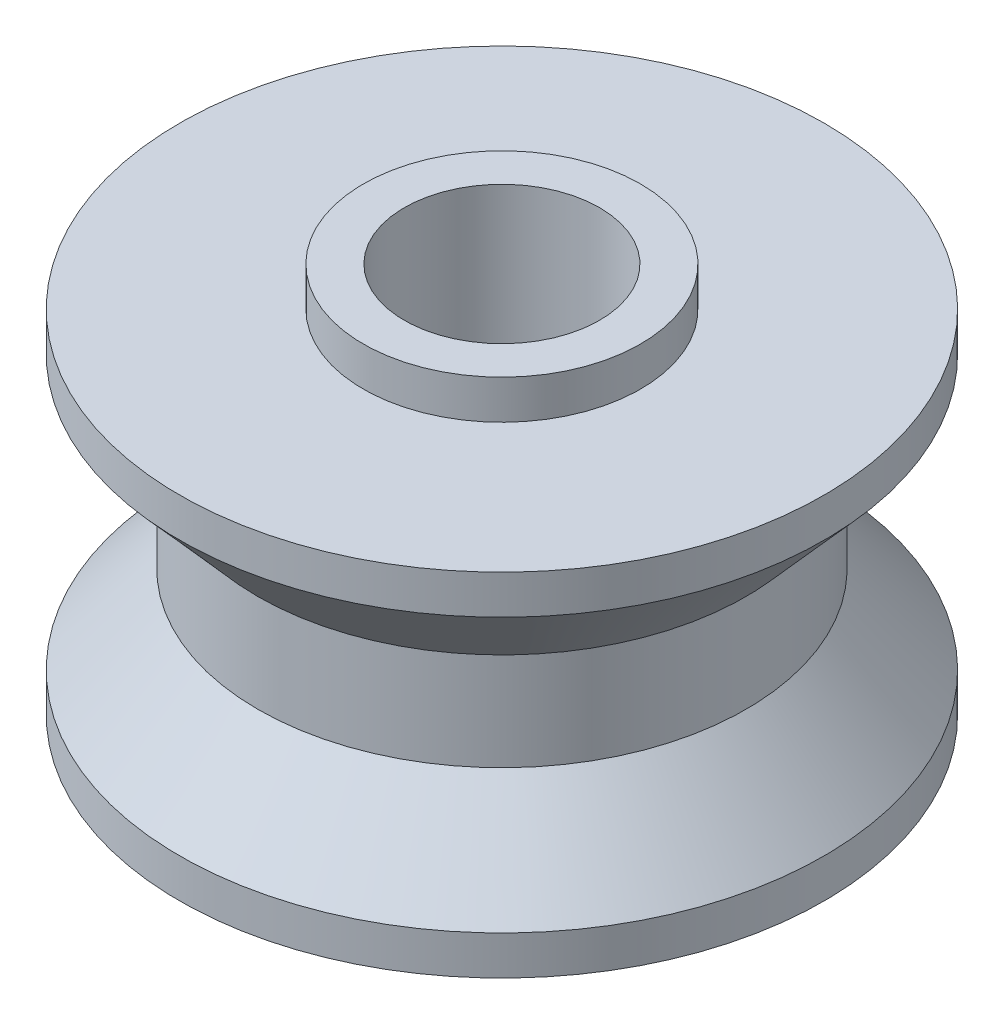
ISO-10303-21;
HEADER;
FILE_DESCRIPTION(('STEP AP214'),'2;1');
FILE_NAME('part.step','',(''),(''),'','','');
FILE_SCHEMA(('AUTOMOTIVE_DESIGN { 1 0 10303 214 1 1 1 1 }'));
ENDSEC;
DATA;
#1=APPLICATION_CONTEXT('core data for automotive mechanical design processes');
#2=APPLICATION_PROTOCOL_DEFINITION('international standard','automotive_design',2000,#1);
#3=PRODUCT_CONTEXT('',#1,'mechanical');
#4=PRODUCT('Part','Part','',(#3));
#5=PRODUCT_RELATED_PRODUCT_CATEGORY('part','',(#4));
#6=PRODUCT_DEFINITION_FORMATION('','',#4);
#7=PRODUCT_DEFINITION_CONTEXT('part definition',#1,'design');
#8=PRODUCT_DEFINITION('design','',#6,#7);
#9=PRODUCT_DEFINITION_SHAPE('','',#8);
#10=(LENGTH_UNIT() NAMED_UNIT(*) SI_UNIT(.MILLI.,.METRE.));
#11=(NAMED_UNIT(*) PLANE_ANGLE_UNIT() SI_UNIT($,.RADIAN.));
#12=(NAMED_UNIT(*) SI_UNIT($,.STERADIAN.) SOLID_ANGLE_UNIT());
#13=UNCERTAINTY_MEASURE_WITH_UNIT(LENGTH_MEASURE(1.E-05),#10,'distance_accuracy_value','');
#14=(GEOMETRIC_REPRESENTATION_CONTEXT(3) GLOBAL_UNCERTAINTY_ASSIGNED_CONTEXT((#13)) GLOBAL_UNIT_ASSIGNED_CONTEXT((#10,
#11,#12)) REPRESENTATION_CONTEXT('',''));
#15=CARTESIAN_POINT('',(0.,0.,0.));
#16=DIRECTION('',(0.,0.,1.));
#17=DIRECTION('',(1.,0.,0.));
#18=AXIS2_PLACEMENT_3D('',#15,#16,#17);
#19=CARTESIAN_POINT('',(0.,0.,0.));
#20=DIRECTION('',(0.,-1.,0.));
#21=DIRECTION('',(0.,0.,-1.));
#22=AXIS2_PLACEMENT_3D('',#19,#20,#21);
#23=CYLINDRICAL_SURFACE('',#22,2.5);
#24=CARTESIAN_POINT('',(0.,-5.5,0.));
#25=DIRECTION('',(0.,-1.,0.));
#26=DIRECTION('',(0.,0.,-1.));
#27=AXIS2_PLACEMENT_3D('',#24,#25,#26);
#28=CIRCLE('',#27,2.5);
#29=CARTESIAN_POINT('',(0.,-5.5,-2.5));
#30=VERTEX_POINT('',#29);
#31=EDGE_CURVE('E10',#30,#30,#28,.T.);
#32=ORIENTED_EDGE('',*,*,#31,.T.);
#33=EDGE_LOOP('',(#32));
#34=FACE_BOUND('',#33,.T.);
#35=CARTESIAN_POINT('',(0.,5.5,0.));
#36=DIRECTION('',(0.,-1.,0.));
#37=DIRECTION('',(0.,0.,-1.));
#38=AXIS2_PLACEMENT_3D('',#35,#36,#37);
#39=CIRCLE('',#38,2.5);
#40=CARTESIAN_POINT('',(0.,5.5,-2.5));
#41=VERTEX_POINT('',#40);
#42=EDGE_CURVE('E72',#41,#41,#39,.T.);
#43=ORIENTED_EDGE('',*,*,#42,.F.);
#44=EDGE_LOOP('',(#43));
#45=FACE_BOUND('',#44,.T.);
#46=ADVANCED_FACE('F32',(#34,#45),#23,.F.);
#47=CARTESIAN_POINT('',(2.5,-5.5,0.));
#48=DIRECTION('',(0.,-1.,0.));
#49=DIRECTION('',(0.,0.,-1.));
#50=AXIS2_PLACEMENT_3D('',#47,#48,#49);
#51=PLANE('',#50);
#52=CARTESIAN_POINT('',(0.,-5.5,0.));
#53=DIRECTION('',(0.,-1.,0.));
#54=DIRECTION('',(0.,0.,-1.));
#55=AXIS2_PLACEMENT_3D('',#52,#53,#54);
#56=CIRCLE('',#55,3.55);
#57=CARTESIAN_POINT('',(0.,-5.5,-3.55));
#58=VERTEX_POINT('',#57);
#59=EDGE_CURVE('E38',#58,#58,#56,.T.);
#60=ORIENTED_EDGE('',*,*,#59,.T.);
#61=EDGE_LOOP('',(#60));
#62=FACE_BOUND('',#61,.T.);
#63=ORIENTED_EDGE('',*,*,#31,.F.);
#64=EDGE_LOOP('',(#63));
#65=FACE_BOUND('',#64,.T.);
#66=ADVANCED_FACE('F80',(#62,#65),#51,.T.);
#67=CARTESIAN_POINT('',(0.,0.,0.));
#68=DIRECTION('',(0.,-1.,0.));
#69=DIRECTION('',(0.,0.,-1.));
#70=AXIS2_PLACEMENT_3D('',#67,#68,#69);
#71=CYLINDRICAL_SURFACE('',#70,3.55);
#72=CARTESIAN_POINT('',(0.,-4.5,0.));
#73=DIRECTION('',(0.,-1.,0.));
#74=DIRECTION('',(0.,0.,-1.));
#75=AXIS2_PLACEMENT_3D('',#72,#73,#74);
#76=CIRCLE('',#75,3.55);
#77=CARTESIAN_POINT('',(0.,-4.5,-3.55));
#78=VERTEX_POINT('',#77);
#79=EDGE_CURVE('E42',#78,#78,#76,.T.);
#80=ORIENTED_EDGE('',*,*,#79,.T.);
#81=EDGE_LOOP('',(#80));
#82=FACE_BOUND('',#81,.T.);
#83=ORIENTED_EDGE('',*,*,#59,.F.);
#84=EDGE_LOOP('',(#83));
#85=FACE_BOUND('',#84,.T.);
#86=ADVANCED_FACE('F84',(#82,#85),#71,.T.);
#87=CARTESIAN_POINT('',(3.55,-4.5,0.));
#88=DIRECTION('',(0.,-1.,0.));
#89=DIRECTION('',(0.,0.,-1.));
#90=AXIS2_PLACEMENT_3D('',#87,#88,#89);
#91=PLANE('',#90);
#92=CARTESIAN_POINT('',(0.,-4.5,0.));
#93=DIRECTION('',(0.,-1.,0.));
#94=DIRECTION('',(0.,0.,-1.));
#95=AXIS2_PLACEMENT_3D('',#92,#93,#94);
#96=CIRCLE('',#95,8.25);
#97=CARTESIAN_POINT('',(0.,-4.5,-8.25));
#98=VERTEX_POINT('',#97);
#99=EDGE_CURVE('E46',#98,#98,#96,.T.);
#100=ORIENTED_EDGE('',*,*,#99,.T.);
#101=EDGE_LOOP('',(#100));
#102=FACE_BOUND('',#101,.T.);
#103=ORIENTED_EDGE('',*,*,#79,.F.);
#104=EDGE_LOOP('',(#103));
#105=FACE_BOUND('',#104,.T.);
#106=ADVANCED_FACE('F88',(#102,#105),#91,.T.);
#107=CARTESIAN_POINT('',(0.,0.,0.));
#108=DIRECTION('',(0.,-1.,0.));
#109=DIRECTION('',(0.,0.,-1.));
#110=AXIS2_PLACEMENT_3D('',#107,#108,#109);
#111=CYLINDRICAL_SURFACE('',#110,8.25);
#112=CARTESIAN_POINT('',(0.,-3.5,0.));
#113=DIRECTION('',(0.,-1.,0.));
#114=DIRECTION('',(0.,0.,-1.));
#115=AXIS2_PLACEMENT_3D('',#112,#113,#114);
#116=CIRCLE('',#115,8.25);
#117=CARTESIAN_POINT('',(0.,-3.5,-8.25));
#118=VERTEX_POINT('',#117);
#119=EDGE_CURVE('E51',#118,#118,#116,.T.);
#120=ORIENTED_EDGE('',*,*,#119,.T.);
#121=EDGE_LOOP('',(#120));
#122=FACE_BOUND('',#121,.T.);
#123=ORIENTED_EDGE('',*,*,#99,.F.);
#124=EDGE_LOOP('',(#123));
#125=FACE_BOUND('',#124,.T.);
#126=ADVANCED_FACE('F95',(#122,#125),#111,.T.);
#127=CARTESIAN_POINT('',(0.,-3.5,0.));
#128=DIRECTION('',(0.,-1.,0.));
#129=DIRECTION('',(0.,0.,-1.));
#130=AXIS2_PLACEMENT_3D('',#127,#128,#129);
#131=CONICAL_SURFACE('',#130,8.25,0.726642340681726);
#132=CARTESIAN_POINT('',(0.,-1.25,0.));
#133=DIRECTION('',(0.,-1.,0.));
#134=DIRECTION('',(0.,0.,-1.));
#135=AXIS2_PLACEMENT_3D('',#132,#133,#134);
#136=CIRCLE('',#135,6.25);
#137=CARTESIAN_POINT('',(0.,-1.25,-6.25));
#138=VERTEX_POINT('',#137);
#139=EDGE_CURVE('E54',#138,#138,#136,.T.);
#140=ORIENTED_EDGE('',*,*,#139,.T.);
#141=EDGE_LOOP('',(#140));
#142=FACE_BOUND('',#141,.T.);
#143=ORIENTED_EDGE('',*,*,#119,.F.);
#144=EDGE_LOOP('',(#143));
#145=FACE_BOUND('',#144,.T.);
#146=ADVANCED_FACE('F99',(#142,#145),#131,.T.);
#147=CARTESIAN_POINT('',(0.,0.,0.));
#148=DIRECTION('',(0.,-1.,0.));
#149=DIRECTION('',(0.,0.,-1.));
#150=AXIS2_PLACEMENT_3D('',#147,#148,#149);
#151=CYLINDRICAL_SURFACE('',#150,6.25);
#152=CARTESIAN_POINT('',(0.,1.25,0.));
#153=DIRECTION('',(0.,-1.,0.));
#154=DIRECTION('',(0.,0.,-1.));
#155=AXIS2_PLACEMENT_3D('',#152,#153,#154);
#156=CIRCLE('',#155,6.25);
#157=CARTESIAN_POINT('',(0.,1.25,-6.25));
#158=VERTEX_POINT('',#157);
#159=EDGE_CURVE('E57',#158,#158,#156,.T.);
#160=ORIENTED_EDGE('',*,*,#159,.T.);
#161=EDGE_LOOP('',(#160));
#162=FACE_BOUND('',#161,.T.);
#163=ORIENTED_EDGE('',*,*,#139,.F.);
#164=EDGE_LOOP('',(#163));
#165=FACE_BOUND('',#164,.T.);
#166=ADVANCED_FACE('F103',(#162,#165),#151,.T.);
#167=CARTESIAN_POINT('',(0.,1.25,0.));
#168=DIRECTION('',(0.,1.,0.));
#169=DIRECTION('',(0.,0.,1.));
#170=AXIS2_PLACEMENT_3D('',#167,#168,#169);
#171=CONICAL_SURFACE('',#170,6.25,0.726642340681726);
#172=CARTESIAN_POINT('',(0.,3.5,0.));
#173=DIRECTION('',(0.,-1.,0.));
#174=DIRECTION('',(0.,0.,-1.));
#175=AXIS2_PLACEMENT_3D('',#172,#173,#174);
#176=CIRCLE('',#175,8.25);
#177=CARTESIAN_POINT('',(0.,3.5,-8.25));
#178=VERTEX_POINT('',#177);
#179=EDGE_CURVE('E60',#178,#178,#176,.T.);
#180=ORIENTED_EDGE('',*,*,#179,.T.);
#181=EDGE_LOOP('',(#180));
#182=FACE_BOUND('',#181,.T.);
#183=ORIENTED_EDGE('',*,*,#159,.F.);
#184=EDGE_LOOP('',(#183));
#185=FACE_BOUND('',#184,.T.);
#186=ADVANCED_FACE('F107',(#182,#185),#171,.T.);
#187=CARTESIAN_POINT('',(0.,0.,0.));
#188=DIRECTION('',(0.,-1.,0.));
#189=DIRECTION('',(0.,0.,-1.));
#190=AXIS2_PLACEMENT_3D('',#187,#188,#189);
#191=CYLINDRICAL_SURFACE('',#190,8.25);
#192=CARTESIAN_POINT('',(0.,4.5,0.));
#193=DIRECTION('',(0.,-1.,0.));
#194=DIRECTION('',(0.,0.,-1.));
#195=AXIS2_PLACEMENT_3D('',#192,#193,#194);
#196=CIRCLE('',#195,8.25);
#197=CARTESIAN_POINT('',(0.,4.5,-8.25));
#198=VERTEX_POINT('',#197);
#199=EDGE_CURVE('E63',#198,#198,#196,.T.);
#200=ORIENTED_EDGE('',*,*,#199,.T.);
#201=EDGE_LOOP('',(#200));
#202=FACE_BOUND('',#201,.T.);
#203=ORIENTED_EDGE('',*,*,#179,.F.);
#204=EDGE_LOOP('',(#203));
#205=FACE_BOUND('',#204,.T.);
#206=ADVANCED_FACE('F111',(#202,#205),#191,.T.);
#207=CARTESIAN_POINT('',(3.55,4.5,0.));
#208=DIRECTION('',(0.,1.,0.));
#209=DIRECTION('',(0.,0.,1.));
#210=AXIS2_PLACEMENT_3D('',#207,#208,#209);
#211=PLANE('',#210);
#212=CARTESIAN_POINT('',(0.,4.5,0.));
#213=DIRECTION('',(0.,-1.,0.));
#214=DIRECTION('',(0.,0.,-1.));
#215=AXIS2_PLACEMENT_3D('',#212,#213,#214);
#216=CIRCLE('',#215,3.55);
#217=CARTESIAN_POINT('',(0.,4.5,-3.55));
#218=VERTEX_POINT('',#217);
#219=EDGE_CURVE('E66',#218,#218,#216,.T.);
#220=ORIENTED_EDGE('',*,*,#219,.T.);
#221=EDGE_LOOP('',(#220));
#222=FACE_BOUND('',#221,.T.);
#223=ORIENTED_EDGE('',*,*,#199,.F.);
#224=EDGE_LOOP('',(#223));
#225=FACE_BOUND('',#224,.T.);
#226=ADVANCED_FACE('F115',(#222,#225),#211,.T.);
#227=CARTESIAN_POINT('',(0.,0.,0.));
#228=DIRECTION('',(0.,-1.,0.));
#229=DIRECTION('',(0.,0.,-1.));
#230=AXIS2_PLACEMENT_3D('',#227,#228,#229);
#231=CYLINDRICAL_SURFACE('',#230,3.55);
#232=CARTESIAN_POINT('',(0.,5.5,0.));
#233=DIRECTION('',(0.,-1.,0.));
#234=DIRECTION('',(0.,0.,-1.));
#235=AXIS2_PLACEMENT_3D('',#232,#233,#234);
#236=CIRCLE('',#235,3.55);
#237=CARTESIAN_POINT('',(0.,5.5,-3.55));
#238=VERTEX_POINT('',#237);
#239=EDGE_CURVE('E69',#238,#238,#236,.T.);
#240=ORIENTED_EDGE('',*,*,#239,.T.);
#241=EDGE_LOOP('',(#240));
#242=FACE_BOUND('',#241,.T.);
#243=ORIENTED_EDGE('',*,*,#219,.F.);
#244=EDGE_LOOP('',(#243));
#245=FACE_BOUND('',#244,.T.);
#246=ADVANCED_FACE('F119',(#242,#245),#231,.T.);
#247=CARTESIAN_POINT('',(2.5,5.5,0.));
#248=DIRECTION('',(0.,1.,0.));
#249=DIRECTION('',(0.,0.,1.));
#250=AXIS2_PLACEMENT_3D('',#247,#248,#249);
#251=PLANE('',#250);
#252=ORIENTED_EDGE('',*,*,#42,.T.);
#253=EDGE_LOOP('',(#252));
#254=FACE_BOUND('',#253,.T.);
#255=ORIENTED_EDGE('',*,*,#239,.F.);
#256=EDGE_LOOP('',(#255));
#257=FACE_BOUND('',#256,.T.);
#258=ADVANCED_FACE('F76',(#254,#257),#251,.T.);
#259=CLOSED_SHELL('',(#46,#66,#86,#106,#126,#146,#166,#186,#206,#226,#246,#258));
#260=MANIFOLD_SOLID_BREP('B2',#259);
#261=ADVANCED_BREP_SHAPE_REPRESENTATION('',(#18,#260),#14);
#262=SHAPE_DEFINITION_REPRESENTATION(#9,#261);
ENDSEC;
END-ISO-10303-21;
